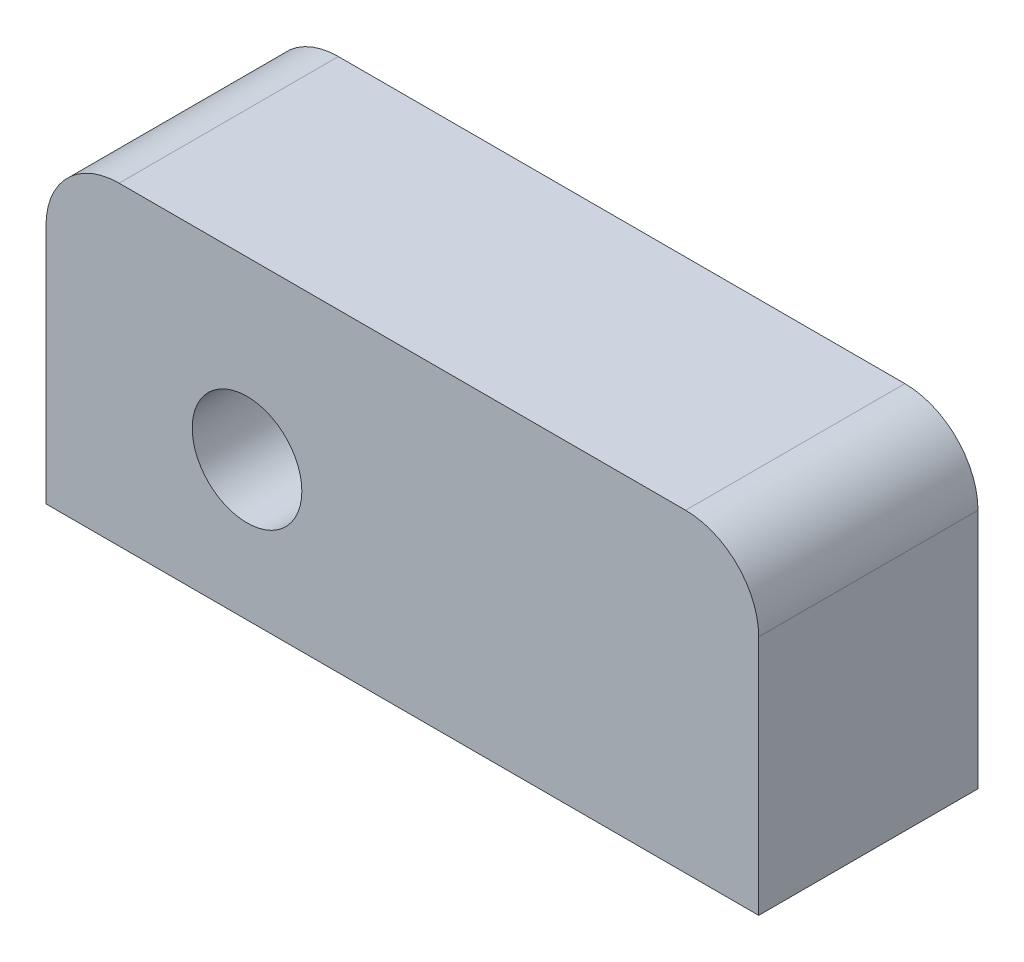
ISO-10303-21;
HEADER;
FILE_DESCRIPTION(('STEP AP214'),'2;1');
FILE_NAME('part.step','',(''),(''),'','','');
FILE_SCHEMA(('AUTOMOTIVE_DESIGN { 1 0 10303 214 1 1 1 1 }'));
ENDSEC;
DATA;
#1=APPLICATION_CONTEXT('core data for automotive mechanical design processes');
#2=APPLICATION_PROTOCOL_DEFINITION('international standard','automotive_design',2000,#1);
#3=PRODUCT_CONTEXT('',#1,'mechanical');
#4=PRODUCT('Part','Part','',(#3));
#5=PRODUCT_RELATED_PRODUCT_CATEGORY('part','',(#4));
#6=PRODUCT_DEFINITION_FORMATION('','',#4);
#7=PRODUCT_DEFINITION_CONTEXT('part definition',#1,'design');
#8=PRODUCT_DEFINITION('design','',#6,#7);
#9=PRODUCT_DEFINITION_SHAPE('','',#8);
#10=(LENGTH_UNIT() NAMED_UNIT(*) SI_UNIT(.MILLI.,.METRE.));
#11=(NAMED_UNIT(*) PLANE_ANGLE_UNIT() SI_UNIT($,.RADIAN.));
#12=(NAMED_UNIT(*) SI_UNIT($,.STERADIAN.) SOLID_ANGLE_UNIT());
#13=UNCERTAINTY_MEASURE_WITH_UNIT(LENGTH_MEASURE(1.E-05),#10,'distance_accuracy_value','');
#14=(GEOMETRIC_REPRESENTATION_CONTEXT(3) GLOBAL_UNCERTAINTY_ASSIGNED_CONTEXT((#13)) GLOBAL_UNIT_ASSIGNED_CONTEXT((#10,
#11,#12)) REPRESENTATION_CONTEXT('',''));
#15=CARTESIAN_POINT('',(0.,0.,0.));
#16=DIRECTION('',(0.,0.,1.));
#17=DIRECTION('',(1.,0.,0.));
#18=AXIS2_PLACEMENT_3D('',#15,#16,#17);
#19=CARTESIAN_POINT('',(48.75,-21.5,30.));
#20=DIRECTION('',(-1.,0.,0.));
#21=DIRECTION('',(0.,0.,1.));
#22=AXIS2_PLACEMENT_3D('',#19,#20,#21);
#23=PLANE('',#22);
#24=DIRECTION('',(0.,1.,0.));
#25=VECTOR('',#24,1.);
#26=CARTESIAN_POINT('',(48.75,-21.5,0.));
#27=LINE('',#26,#25);
#28=CARTESIAN_POINT('',(48.75,-21.5,0.));
#29=VERTEX_POINT('',#28);
#30=CARTESIAN_POINT('',(48.75,11.5,0.));
#31=VERTEX_POINT('',#30);
#32=EDGE_CURVE('E114',#29,#31,#27,.T.);
#33=ORIENTED_EDGE('',*,*,#32,.T.);
#34=DIRECTION('',(0.,0.,-1.));
#35=VECTOR('',#34,1.);
#36=CARTESIAN_POINT('',(48.75,11.5,30.));
#37=LINE('',#36,#35);
#38=CARTESIAN_POINT('',(48.75,11.5,30.));
#39=VERTEX_POINT('',#38);
#40=EDGE_CURVE('E41',#31,#39,#37,.F.);
#41=ORIENTED_EDGE('',*,*,#40,.T.);
#42=DIRECTION('',(0.,1.,0.));
#43=VECTOR('',#42,1.);
#44=CARTESIAN_POINT('',(48.75,-21.5,30.));
#45=LINE('',#44,#43);
#46=CARTESIAN_POINT('',(48.75,-21.5,30.));
#47=VERTEX_POINT('',#46);
#48=EDGE_CURVE('E121',#47,#39,#45,.T.);
#49=ORIENTED_EDGE('',*,*,#48,.F.);
#50=DIRECTION('',(0.,0.,-1.));
#51=VECTOR('',#50,1.);
#52=CARTESIAN_POINT('',(48.75,-21.5,30.));
#53=LINE('',#52,#51);
#54=EDGE_CURVE('E106',#47,#29,#53,.T.);
#55=ORIENTED_EDGE('',*,*,#54,.T.);
#56=EDGE_LOOP('',(#33,#41,#49,#55));
#57=FACE_BOUND('',#56,.T.);
#58=ADVANCED_FACE('F33',(#57),#23,.F.);
#59=CARTESIAN_POINT('',(-48.75,21.5,30.));
#60=DIRECTION('',(0.,-1.,0.));
#61=DIRECTION('',(0.,0.,-1.));
#62=AXIS2_PLACEMENT_3D('',#59,#60,#61);
#63=PLANE('',#62);
#64=DIRECTION('',(-1.,0.,0.));
#65=VECTOR('',#64,1.);
#66=CARTESIAN_POINT('',(-48.75,21.5,30.));
#67=LINE('',#66,#65);
#68=CARTESIAN_POINT('',(38.75,21.5,30.));
#69=VERTEX_POINT('',#68);
#70=CARTESIAN_POINT('',(-38.75,21.5,30.));
#71=VERTEX_POINT('',#70);
#72=EDGE_CURVE('E96',#69,#71,#67,.T.);
#73=ORIENTED_EDGE('',*,*,#72,.F.);
#74=DIRECTION('',(0.,0.,-1.));
#75=VECTOR('',#74,1.);
#76=CARTESIAN_POINT('',(38.75,21.5,30.));
#77=LINE('',#76,#75);
#78=CARTESIAN_POINT('',(38.75,21.5,0.));
#79=VERTEX_POINT('',#78);
#80=EDGE_CURVE('E131',#69,#79,#77,.T.);
#81=ORIENTED_EDGE('',*,*,#80,.T.);
#82=DIRECTION('',(-1.,0.,0.));
#83=VECTOR('',#82,1.);
#84=CARTESIAN_POINT('',(-48.75,21.5,0.));
#85=LINE('',#84,#83);
#86=CARTESIAN_POINT('',(-38.75,21.5,0.));
#87=VERTEX_POINT('',#86);
#88=EDGE_CURVE('E116',#79,#87,#85,.T.);
#89=ORIENTED_EDGE('',*,*,#88,.T.);
#90=DIRECTION('',(0.,0.,-1.));
#91=VECTOR('',#90,1.);
#92=CARTESIAN_POINT('',(-38.75,21.5,30.));
#93=LINE('',#92,#91);
#94=EDGE_CURVE('E127',#87,#71,#93,.F.);
#95=ORIENTED_EDGE('',*,*,#94,.T.);
#96=EDGE_LOOP('',(#73,#81,#89,#95));
#97=FACE_BOUND('',#96,.T.);
#98=ADVANCED_FACE('F137',(#97),#63,.F.);
#99=CARTESIAN_POINT('',(-48.75,-21.5,30.));
#100=DIRECTION('',(1.,0.,0.));
#101=DIRECTION('',(0.,0.,-1.));
#102=AXIS2_PLACEMENT_3D('',#99,#100,#101);
#103=PLANE('',#102);
#104=DIRECTION('',(0.,-1.,0.));
#105=VECTOR('',#104,1.);
#106=CARTESIAN_POINT('',(-48.75,-21.5,30.));
#107=LINE('',#106,#105);
#108=CARTESIAN_POINT('',(-48.75,11.5,30.));
#109=VERTEX_POINT('',#108);
#110=CARTESIAN_POINT('',(-48.75,-21.5,30.));
#111=VERTEX_POINT('',#110);
#112=EDGE_CURVE('E85',#109,#111,#107,.T.);
#113=ORIENTED_EDGE('',*,*,#112,.F.);
#114=DIRECTION('',(0.,0.,-1.));
#115=VECTOR('',#114,1.);
#116=CARTESIAN_POINT('',(-48.75,11.5,30.));
#117=LINE('',#116,#115);
#118=CARTESIAN_POINT('',(-48.75,11.5,0.));
#119=VERTEX_POINT('',#118);
#120=EDGE_CURVE('E105',#109,#119,#117,.T.);
#121=ORIENTED_EDGE('',*,*,#120,.T.);
#122=DIRECTION('',(0.,-1.,0.));
#123=VECTOR('',#122,1.);
#124=CARTESIAN_POINT('',(-48.75,-21.5,0.));
#125=LINE('',#124,#123);
#126=CARTESIAN_POINT('',(-48.75,-21.5,0.));
#127=VERTEX_POINT('',#126);
#128=EDGE_CURVE('E102',#119,#127,#125,.T.);
#129=ORIENTED_EDGE('',*,*,#128,.T.);
#130=DIRECTION('',(0.,0.,-1.));
#131=VECTOR('',#130,1.);
#132=CARTESIAN_POINT('',(-48.75,-21.5,30.));
#133=LINE('',#132,#131);
#134=EDGE_CURVE('E99',#111,#127,#133,.T.);
#135=ORIENTED_EDGE('',*,*,#134,.F.);
#136=EDGE_LOOP('',(#113,#121,#129,#135));
#137=FACE_BOUND('',#136,.T.);
#138=ADVANCED_FACE('F100',(#137),#103,.F.);
#139=CARTESIAN_POINT('',(-48.75,-21.5,30.));
#140=DIRECTION('',(0.,1.,0.));
#141=DIRECTION('',(0.,0.,1.));
#142=AXIS2_PLACEMENT_3D('',#139,#140,#141);
#143=PLANE('',#142);
#144=DIRECTION('',(1.,0.,0.));
#145=VECTOR('',#144,1.);
#146=CARTESIAN_POINT('',(-48.75,-21.5,0.));
#147=LINE('',#146,#145);
#148=EDGE_CURVE('E120',#127,#29,#147,.T.);
#149=ORIENTED_EDGE('',*,*,#148,.T.);
#150=ORIENTED_EDGE('',*,*,#54,.F.);
#151=DIRECTION('',(1.,0.,0.));
#152=VECTOR('',#151,1.);
#153=CARTESIAN_POINT('',(-48.75,-21.5,30.));
#154=LINE('',#153,#152);
#155=EDGE_CURVE('E89',#111,#47,#154,.T.);
#156=ORIENTED_EDGE('',*,*,#155,.F.);
#157=ORIENTED_EDGE('',*,*,#134,.T.);
#158=EDGE_LOOP('',(#149,#150,#156,#157));
#159=FACE_BOUND('',#158,.T.);
#160=ADVANCED_FACE('F108',(#159),#143,.F.);
#161=CARTESIAN_POINT('',(0.,0.,30.));
#162=DIRECTION('',(0.,0.,-1.));
#163=DIRECTION('',(-1.,0.,0.));
#164=AXIS2_PLACEMENT_3D('',#161,#162,#163);
#165=PLANE('',#164);
#166=CARTESIAN_POINT('',(-21.25,-2.5,30.));
#167=DIRECTION('',(0.,0.,1.));
#168=DIRECTION('',(1.,0.,0.));
#169=AXIS2_PLACEMENT_3D('',#166,#167,#168);
#170=CIRCLE('',#169,7.5);
#171=CARTESIAN_POINT('',(-13.75,-2.5,30.));
#172=VERTEX_POINT('',#171);
#173=EDGE_CURVE('E175',#172,#172,#170,.T.);
#174=ORIENTED_EDGE('',*,*,#173,.F.);
#175=EDGE_LOOP('',(#174));
#176=FACE_BOUND('',#175,.T.);
#177=ORIENTED_EDGE('',*,*,#48,.T.);
#178=CARTESIAN_POINT('',(38.75,11.5,30.));
#179=DIRECTION('',(0.,0.,-1.));
#180=DIRECTION('',(-1.,0.,0.));
#181=AXIS2_PLACEMENT_3D('',#178,#179,#180);
#182=CIRCLE('',#181,10.);
#183=EDGE_CURVE('E11',#39,#69,#182,.F.);
#184=ORIENTED_EDGE('',*,*,#183,.T.);
#185=ORIENTED_EDGE('',*,*,#72,.T.);
#186=CARTESIAN_POINT('',(-38.75,11.5,30.));
#187=DIRECTION('',(0.,0.,-1.));
#188=DIRECTION('',(-1.,0.,0.));
#189=AXIS2_PLACEMENT_3D('',#186,#187,#188);
#190=CIRCLE('',#189,10.);
#191=EDGE_CURVE('E92',#71,#109,#190,.F.);
#192=ORIENTED_EDGE('',*,*,#191,.T.);
#193=ORIENTED_EDGE('',*,*,#112,.T.);
#194=ORIENTED_EDGE('',*,*,#155,.T.);
#195=EDGE_LOOP('',(#177,#184,#185,#192,#193,#194));
#196=FACE_BOUND('',#195,.T.);
#197=ADVANCED_FACE('F87',(#176,#196),#165,.F.);
#198=CARTESIAN_POINT('',(0.,0.,0.));
#199=DIRECTION('',(0.,0.,-1.));
#200=DIRECTION('',(-1.,0.,0.));
#201=AXIS2_PLACEMENT_3D('',#198,#199,#200);
#202=PLANE('',#201);
#203=CARTESIAN_POINT('',(-21.25,-2.5,0.));
#204=DIRECTION('',(0.,0.,1.));
#205=DIRECTION('',(1.,0.,0.));
#206=AXIS2_PLACEMENT_3D('',#203,#204,#205);
#207=CIRCLE('',#206,7.5);
#208=CARTESIAN_POINT('',(-13.75,-2.5,0.));
#209=VERTEX_POINT('',#208);
#210=EDGE_CURVE('E117',#209,#209,#207,.T.);
#211=ORIENTED_EDGE('',*,*,#210,.T.);
#212=EDGE_LOOP('',(#211));
#213=FACE_BOUND('',#212,.T.);
#214=ORIENTED_EDGE('',*,*,#88,.F.);
#215=CARTESIAN_POINT('',(38.75,11.5,0.));
#216=DIRECTION('',(0.,0.,-1.));
#217=DIRECTION('',(-1.,0.,0.));
#218=AXIS2_PLACEMENT_3D('',#215,#216,#217);
#219=CIRCLE('',#218,10.);
#220=EDGE_CURVE('E55',#79,#31,#219,.T.);
#221=ORIENTED_EDGE('',*,*,#220,.T.);
#222=ORIENTED_EDGE('',*,*,#32,.F.);
#223=ORIENTED_EDGE('',*,*,#148,.F.);
#224=ORIENTED_EDGE('',*,*,#128,.F.);
#225=CARTESIAN_POINT('',(-38.75,11.5,0.));
#226=DIRECTION('',(0.,0.,-1.));
#227=DIRECTION('',(-1.,0.,0.));
#228=AXIS2_PLACEMENT_3D('',#225,#226,#227);
#229=CIRCLE('',#228,10.);
#230=EDGE_CURVE('E124',#119,#87,#229,.T.);
#231=ORIENTED_EDGE('',*,*,#230,.T.);
#232=EDGE_LOOP('',(#214,#221,#222,#223,#224,#231));
#233=FACE_BOUND('',#232,.T.);
#234=ADVANCED_FACE('F140',(#213,#233),#202,.T.);
#235=CARTESIAN_POINT('',(-38.75,11.5,30.));
#236=DIRECTION('',(0.,0.,-1.));
#237=DIRECTION('',(-1.,0.,0.));
#238=AXIS2_PLACEMENT_3D('',#235,#236,#237);
#239=CYLINDRICAL_SURFACE('',#238,10.);
#240=ORIENTED_EDGE('',*,*,#191,.F.);
#241=ORIENTED_EDGE('',*,*,#94,.F.);
#242=ORIENTED_EDGE('',*,*,#230,.F.);
#243=ORIENTED_EDGE('',*,*,#120,.F.);
#244=EDGE_LOOP('',(#240,#241,#242,#243));
#245=FACE_BOUND('',#244,.T.);
#246=ADVANCED_FACE('F143',(#245),#239,.T.);
#247=CARTESIAN_POINT('',(38.75,11.5,30.));
#248=DIRECTION('',(0.,0.,-1.));
#249=DIRECTION('',(-1.,0.,0.));
#250=AXIS2_PLACEMENT_3D('',#247,#248,#249);
#251=CYLINDRICAL_SURFACE('',#250,10.);
#252=ORIENTED_EDGE('',*,*,#183,.F.);
#253=ORIENTED_EDGE('',*,*,#40,.F.);
#254=ORIENTED_EDGE('',*,*,#220,.F.);
#255=ORIENTED_EDGE('',*,*,#80,.F.);
#256=EDGE_LOOP('',(#252,#253,#254,#255));
#257=FACE_BOUND('',#256,.T.);
#258=ADVANCED_FACE('F35',(#257),#251,.T.);
#259=CARTESIAN_POINT('',(-21.25,-2.5,0.));
#260=DIRECTION('',(0.,0.,1.));
#261=DIRECTION('',(1.,0.,0.));
#262=AXIS2_PLACEMENT_3D('',#259,#260,#261);
#263=CYLINDRICAL_SURFACE('',#262,7.5);
#264=ORIENTED_EDGE('',*,*,#210,.F.);
#265=EDGE_LOOP('',(#264));
#266=FACE_BOUND('',#265,.T.);
#267=ORIENTED_EDGE('',*,*,#173,.T.);
#268=EDGE_LOOP('',(#267));
#269=FACE_BOUND('',#268,.T.);
#270=ADVANCED_FACE('F149',(#266,#269),#263,.F.);
#271=CLOSED_SHELL('',(#58,#98,#138,#160,#197,#234,#246,#258,#270));
#272=MANIFOLD_SOLID_BREP('B2',#271);
#273=ADVANCED_BREP_SHAPE_REPRESENTATION('',(#18,#272),#14);
#274=SHAPE_DEFINITION_REPRESENTATION(#9,#273);
ENDSEC;
END-ISO-10303-21;
